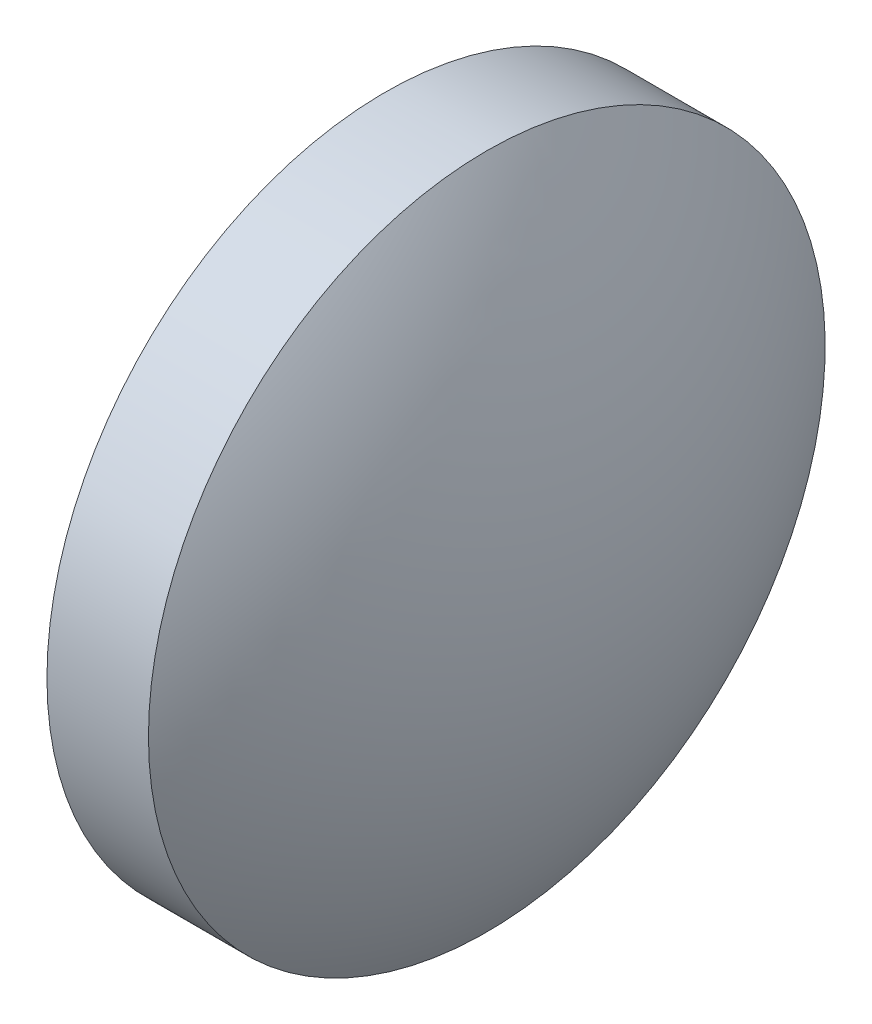
ISO-10303-21;
HEADER;
FILE_DESCRIPTION(('STEP AP214'),'2;1');
FILE_NAME('part.step','',(''),(''),'','','');
FILE_SCHEMA(('AUTOMOTIVE_DESIGN { 1 0 10303 214 1 1 1 1 }'));
ENDSEC;
DATA;
#1=APPLICATION_CONTEXT('core data for automotive mechanical design processes');
#2=APPLICATION_PROTOCOL_DEFINITION('international standard','automotive_design',2000,#1);
#3=PRODUCT_CONTEXT('',#1,'mechanical');
#4=PRODUCT('Part','Part','',(#3));
#5=PRODUCT_RELATED_PRODUCT_CATEGORY('part','',(#4));
#6=PRODUCT_DEFINITION_FORMATION('','',#4);
#7=PRODUCT_DEFINITION_CONTEXT('part definition',#1,'design');
#8=PRODUCT_DEFINITION('design','',#6,#7);
#9=PRODUCT_DEFINITION_SHAPE('','',#8);
#10=(LENGTH_UNIT() NAMED_UNIT(*) SI_UNIT(.MILLI.,.METRE.));
#11=(NAMED_UNIT(*) PLANE_ANGLE_UNIT() SI_UNIT($,.RADIAN.));
#12=(NAMED_UNIT(*) SI_UNIT($,.STERADIAN.) SOLID_ANGLE_UNIT());
#13=UNCERTAINTY_MEASURE_WITH_UNIT(LENGTH_MEASURE(1.E-05),#10,'distance_accuracy_value','');
#14=(GEOMETRIC_REPRESENTATION_CONTEXT(3) GLOBAL_UNCERTAINTY_ASSIGNED_CONTEXT((#13)) GLOBAL_UNIT_ASSIGNED_CONTEXT((#10,
#11,#12)) REPRESENTATION_CONTEXT('',''));
#15=CARTESIAN_POINT('',(0.,0.,0.));
#16=DIRECTION('',(0.,0.,1.));
#17=DIRECTION('',(1.,0.,0.));
#18=AXIS2_PLACEMENT_3D('',#15,#16,#17);
#19=CARTESIAN_POINT('',(358.578482131843,37.0640189544935,0.));
#20=DIRECTION('',(-1.,0.,0.));
#21=DIRECTION('',(0.,1.,0.));
#22=AXIS2_PLACEMENT_3D('',#19,#20,#21);
#23=SPHERICAL_SURFACE('',#22,9.08333333333339);
#24=CARTESIAN_POINT('',(366.161815465176,37.0640189544935,0.));
#25=DIRECTION('',(-1.,0.,0.));
#26=DIRECTION('',(0.,0.,1.));
#27=AXIS2_PLACEMENT_3D('',#24,#25,#26);
#28=CIRCLE('',#27,5.);
#29=CARTESIAN_POINT('',(366.161815465176,37.0640189544935,5.));
#30=VERTEX_POINT('',#29);
#31=EDGE_CURVE('E10',#30,#30,#28,.T.);
#32=ORIENTED_EDGE('',*,*,#31,.F.);
#33=EDGE_LOOP('',(#32));
#34=FACE_BOUND('',#33,.T.);
#35=ADVANCED_FACE('F35',(#34),#23,.T.);
#36=CARTESIAN_POINT('',(363.519585772732,37.0640189544935,0.));
#37=DIRECTION('',(-1.,0.,0.));
#38=DIRECTION('',(0.,0.,1.));
#39=AXIS2_PLACEMENT_3D('',#36,#37,#38);
#40=CYLINDRICAL_SURFACE('',#39,5.);
#41=CARTESIAN_POINT('',(364.661815465176,37.0640189544935,0.));
#42=DIRECTION('',(-1.,0.,0.));
#43=DIRECTION('',(0.,0.,1.));
#44=AXIS2_PLACEMENT_3D('',#41,#42,#43);
#45=CIRCLE('',#44,5.);
#46=CARTESIAN_POINT('',(364.661815465176,37.0640189544935,5.));
#47=VERTEX_POINT('',#46);
#48=EDGE_CURVE('E41',#47,#47,#45,.T.);
#49=ORIENTED_EDGE('',*,*,#48,.F.);
#50=EDGE_LOOP('',(#49));
#51=FACE_BOUND('',#50,.T.);
#52=ORIENTED_EDGE('',*,*,#31,.T.);
#53=EDGE_LOOP('',(#52));
#54=FACE_BOUND('',#53,.T.);
#55=ADVANCED_FACE('F49',(#51,#54),#40,.T.);
#56=CARTESIAN_POINT('',(364.661815465176,37.0640189544935,0.));
#57=DIRECTION('',(1.,0.,0.));
#58=DIRECTION('',(0.,0.,-1.));
#59=AXIS2_PLACEMENT_3D('',#56,#57,#58);
#60=PLANE('',#59);
#61=ORIENTED_EDGE('',*,*,#48,.T.);
#62=EDGE_LOOP('',(#61));
#63=FACE_BOUND('',#62,.T.);
#64=ADVANCED_FACE('F47',(#63),#60,.F.);
#65=CLOSED_SHELL('',(#35,#55,#64));
#66=MANIFOLD_SOLID_BREP('B2',#65);
#67=ADVANCED_BREP_SHAPE_REPRESENTATION('',(#18,#66),#14);
#68=SHAPE_DEFINITION_REPRESENTATION(#9,#67);
ENDSEC;
END-ISO-10303-21;
